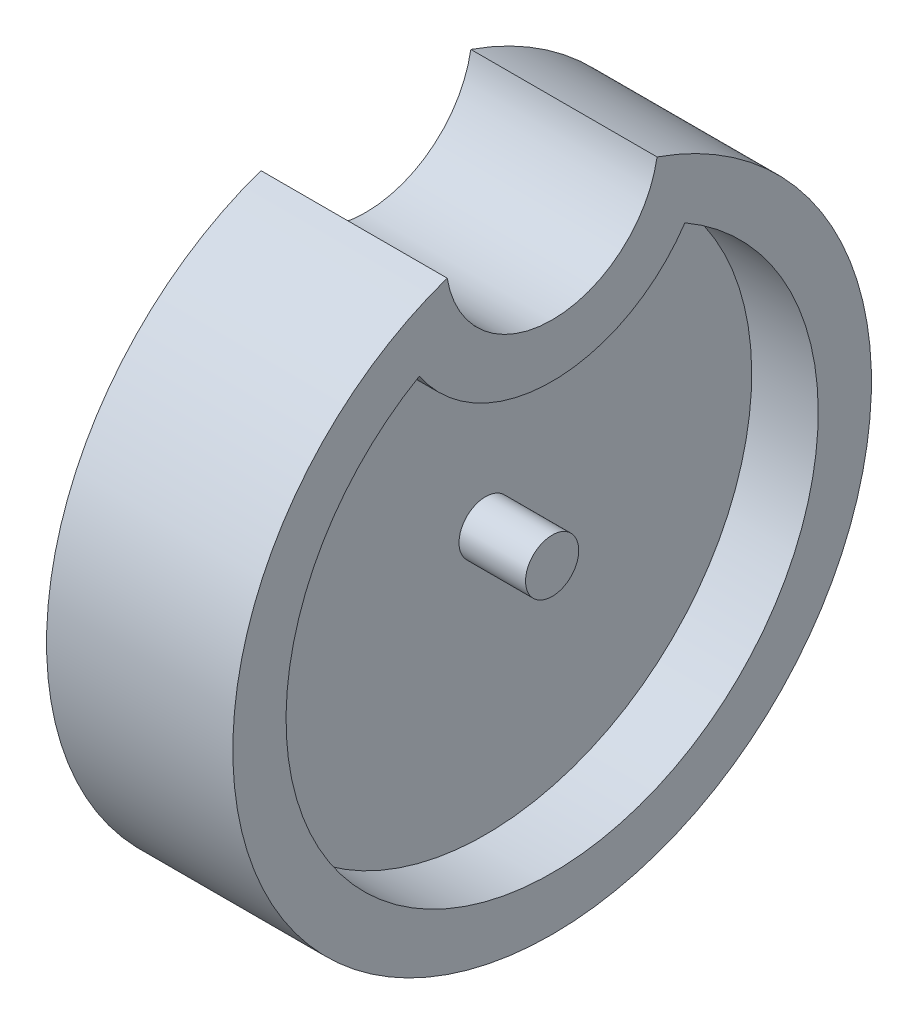
ISO-10303-21;
HEADER;
FILE_DESCRIPTION(('STEP AP214'),'2;1');
FILE_NAME('part.step','',(''),(''),'','','');
FILE_SCHEMA(('AUTOMOTIVE_DESIGN { 1 0 10303 214 1 1 1 1 }'));
ENDSEC;
DATA;
#1=APPLICATION_CONTEXT('core data for automotive mechanical design processes');
#2=APPLICATION_PROTOCOL_DEFINITION('international standard','automotive_design',2000,#1);
#3=PRODUCT_CONTEXT('',#1,'mechanical');
#4=PRODUCT('Part','Part','',(#3));
#5=PRODUCT_RELATED_PRODUCT_CATEGORY('part','',(#4));
#6=PRODUCT_DEFINITION_FORMATION('','',#4);
#7=PRODUCT_DEFINITION_CONTEXT('part definition',#1,'design');
#8=PRODUCT_DEFINITION('design','',#6,#7);
#9=PRODUCT_DEFINITION_SHAPE('','',#8);
#10=(LENGTH_UNIT() NAMED_UNIT(*) SI_UNIT(.MILLI.,.METRE.));
#11=(NAMED_UNIT(*) PLANE_ANGLE_UNIT() SI_UNIT($,.RADIAN.));
#12=(NAMED_UNIT(*) SI_UNIT($,.STERADIAN.) SOLID_ANGLE_UNIT());
#13=UNCERTAINTY_MEASURE_WITH_UNIT(LENGTH_MEASURE(1.E-05),#10,'distance_accuracy_value','');
#14=(GEOMETRIC_REPRESENTATION_CONTEXT(3) GLOBAL_UNCERTAINTY_ASSIGNED_CONTEXT((#13)) GLOBAL_UNIT_ASSIGNED_CONTEXT((#10,
#11,#12)) REPRESENTATION_CONTEXT('',''));
#15=CARTESIAN_POINT('',(0.,0.,0.));
#16=DIRECTION('',(0.,0.,1.));
#17=DIRECTION('',(1.,0.,0.));
#18=AXIS2_PLACEMENT_3D('',#15,#16,#17);
#19=CARTESIAN_POINT('',(5.55625,0.,0.));
#20=DIRECTION('',(-1.,0.,0.));
#21=DIRECTION('',(0.,0.,1.));
#22=AXIS2_PLACEMENT_3D('',#19,#20,#21);
#23=CYLINDRICAL_SURFACE('',#22,15.875);
#24=DIRECTION('',(-1.,0.,0.));
#25=VECTOR('',#24,1.);
#26=CARTESIAN_POINT('',(5.55625,13.7583333333333,7.91984146867151));
#27=LINE('',#26,#25);
#28=CARTESIAN_POINT('',(-1.5875,13.7583333333333,7.91984146867151));
#29=VERTEX_POINT('',#28);
#30=CARTESIAN_POINT('',(-5.55625,13.7583333333333,7.91984146867151));
#31=VERTEX_POINT('',#30);
#32=EDGE_CURVE('E103',#29,#31,#27,.T.);
#33=ORIENTED_EDGE('',*,*,#32,.F.);
#34=CARTESIAN_POINT('',(-1.5875,0.,0.));
#35=DIRECTION('',(1.,0.,0.));
#36=DIRECTION('',(0.,0.,-1.));
#37=AXIS2_PLACEMENT_3D('',#34,#35,#36);
#38=CIRCLE('',#37,15.875);
#39=CARTESIAN_POINT('',(-1.5875,13.7583333333333,-7.91984146867151));
#40=VERTEX_POINT('',#39);
#41=EDGE_CURVE('E56',#29,#40,#38,.T.);
#42=ORIENTED_EDGE('',*,*,#41,.T.);
#43=DIRECTION('',(-1.,0.,0.));
#44=VECTOR('',#43,1.);
#45=CARTESIAN_POINT('',(5.55625,13.7583333333333,-7.91984146867151));
#46=LINE('',#45,#44);
#47=CARTESIAN_POINT('',(-5.55625,13.7583333333333,-7.91984146867151));
#48=VERTEX_POINT('',#47);
#49=EDGE_CURVE('E102',#40,#48,#46,.T.);
#50=ORIENTED_EDGE('',*,*,#49,.T.);
#51=CARTESIAN_POINT('',(-5.55625,0.,0.));
#52=DIRECTION('',(1.,0.,0.));
#53=DIRECTION('',(0.,0.,-1.));
#54=AXIS2_PLACEMENT_3D('',#51,#52,#53);
#55=CIRCLE('',#54,15.875);
#56=EDGE_CURVE('E111',#31,#48,#55,.T.);
#57=ORIENTED_EDGE('',*,*,#56,.F.);
#58=EDGE_LOOP('',(#33,#42,#50,#57));
#59=FACE_BOUND('',#58,.T.);
#60=ADVANCED_FACE('F39',(#59),#23,.F.);
#61=CARTESIAN_POINT('',(5.55625,19.05,0.));
#62=DIRECTION('',(-1.,0.,0.));
#63=DIRECTION('',(0.,0.,1.));
#64=AXIS2_PLACEMENT_3D('',#61,#62,#63);
#65=CYLINDRICAL_SURFACE('',#64,9.525);
#66=ORIENTED_EDGE('',*,*,#49,.F.);
#67=CARTESIAN_POINT('',(-1.5875,19.05,0.));
#68=DIRECTION('',(1.,0.,0.));
#69=DIRECTION('',(0.,0.,-1.));
#70=AXIS2_PLACEMENT_3D('',#67,#68,#69);
#71=CIRCLE('',#70,9.525);
#72=EDGE_CURVE('E117',#29,#40,#71,.T.);
#73=ORIENTED_EDGE('',*,*,#72,.F.);
#74=ORIENTED_EDGE('',*,*,#32,.T.);
#75=CARTESIAN_POINT('',(-5.55625,19.05,0.));
#76=DIRECTION('',(-1.,0.,0.));
#77=DIRECTION('',(0.,0.,-1.));
#78=AXIS2_PLACEMENT_3D('',#75,#76,#77);
#79=CIRCLE('',#78,9.525);
#80=EDGE_CURVE('E126',#48,#31,#79,.T.);
#81=ORIENTED_EDGE('',*,*,#80,.F.);
#82=EDGE_LOOP('',(#66,#73,#74,#81));
#83=FACE_BOUND('',#82,.T.);
#84=ADVANCED_FACE('F176',(#83),#65,.T.);
#85=CARTESIAN_POINT('',(5.55625,9.525,0.));
#86=DIRECTION('',(1.,0.,0.));
#87=DIRECTION('',(0.,0.,-1.));
#88=AXIS2_PLACEMENT_3D('',#85,#86,#87);
#89=PLANE('',#88);
#90=CARTESIAN_POINT('',(5.55625,19.05,0.));
#91=DIRECTION('',(-1.,0.,0.));
#92=DIRECTION('',(0.,0.,-1.));
#93=AXIS2_PLACEMENT_3D('',#90,#91,#92);
#94=CIRCLE('',#93,6.35);
#95=CARTESIAN_POINT('',(5.55625,17.9916666666667,-6.26118443711376));
#96=VERTEX_POINT('',#95);
#97=CARTESIAN_POINT('',(5.55625,17.9916666666667,6.26118443711376));
#98=VERTEX_POINT('',#97);
#99=EDGE_CURVE('E138',#96,#98,#94,.T.);
#100=ORIENTED_EDGE('',*,*,#99,.T.);
#101=CARTESIAN_POINT('',(5.55625,0.,0.));
#102=DIRECTION('',(1.,0.,0.));
#103=DIRECTION('',(0.,0.,-1.));
#104=AXIS2_PLACEMENT_3D('',#101,#102,#103);
#105=CIRCLE('',#104,19.05);
#106=EDGE_CURVE('E142',#98,#96,#105,.T.);
#107=ORIENTED_EDGE('',*,*,#106,.T.);
#108=EDGE_LOOP('',(#100,#107));
#109=FACE_BOUND('',#108,.T.);
#110=CARTESIAN_POINT('',(5.55625,19.05,0.));
#111=DIRECTION('',(-1.,0.,0.));
#112=DIRECTION('',(0.,0.,-1.));
#113=AXIS2_PLACEMENT_3D('',#110,#111,#112);
#114=CIRCLE('',#113,9.525);
#115=CARTESIAN_POINT('',(5.55625,13.7583333333333,-7.91984146867151));
#116=VERTEX_POINT('',#115);
#117=CARTESIAN_POINT('',(5.55625,13.7583333333333,7.91984146867151));
#118=VERTEX_POINT('',#117);
#119=EDGE_CURVE('E97',#116,#118,#114,.T.);
#120=ORIENTED_EDGE('',*,*,#119,.F.);
#121=CARTESIAN_POINT('',(5.55625,0.,0.));
#122=DIRECTION('',(1.,0.,0.));
#123=DIRECTION('',(0.,0.,-1.));
#124=AXIS2_PLACEMENT_3D('',#121,#122,#123);
#125=CIRCLE('',#124,15.875);
#126=EDGE_CURVE('E123',#118,#116,#125,.T.);
#127=ORIENTED_EDGE('',*,*,#126,.F.);
#128=EDGE_LOOP('',(#120,#127));
#129=FACE_BOUND('',#128,.T.);
#130=ADVANCED_FACE('F167',(#109,#129),#89,.T.);
#131=CARTESIAN_POINT('',(-5.55625,9.525,0.));
#132=DIRECTION('',(1.,0.,0.));
#133=DIRECTION('',(0.,0.,-1.));
#134=AXIS2_PLACEMENT_3D('',#131,#132,#133);
#135=PLANE('',#134);
#136=CARTESIAN_POINT('',(-5.55625,19.05,0.));
#137=DIRECTION('',(-1.,0.,0.));
#138=DIRECTION('',(0.,0.,-1.));
#139=AXIS2_PLACEMENT_3D('',#136,#137,#138);
#140=CIRCLE('',#139,6.35);
#141=CARTESIAN_POINT('',(-5.55625,17.9916666666667,-6.26118443711376));
#142=VERTEX_POINT('',#141);
#143=CARTESIAN_POINT('',(-5.55625,17.9916666666667,6.26118443711376));
#144=VERTEX_POINT('',#143);
#145=EDGE_CURVE('E137',#142,#144,#140,.T.);
#146=ORIENTED_EDGE('',*,*,#145,.F.);
#147=CARTESIAN_POINT('',(-5.55625,0.,0.));
#148=DIRECTION('',(1.,0.,0.));
#149=DIRECTION('',(0.,0.,-1.));
#150=AXIS2_PLACEMENT_3D('',#147,#148,#149);
#151=CIRCLE('',#150,19.05);
#152=EDGE_CURVE('E143',#144,#142,#151,.T.);
#153=ORIENTED_EDGE('',*,*,#152,.F.);
#154=EDGE_LOOP('',(#146,#153));
#155=FACE_BOUND('',#154,.T.);
#156=ORIENTED_EDGE('',*,*,#56,.T.);
#157=ORIENTED_EDGE('',*,*,#80,.T.);
#158=EDGE_LOOP('',(#156,#157));
#159=FACE_BOUND('',#158,.T.);
#160=ADVANCED_FACE('F164',(#155,#159),#135,.F.);
#161=CARTESIAN_POINT('',(5.55625,19.05,0.));
#162=DIRECTION('',(-1.,0.,0.));
#163=DIRECTION('',(0.,0.,1.));
#164=AXIS2_PLACEMENT_3D('',#161,#162,#163);
#165=CYLINDRICAL_SURFACE('',#164,6.35);
#166=ORIENTED_EDGE('',*,*,#145,.T.);
#167=DIRECTION('',(-1.,0.,0.));
#168=VECTOR('',#167,1.);
#169=CARTESIAN_POINT('',(5.55625,17.9916666666667,6.26118443711376));
#170=LINE('',#169,#168);
#171=EDGE_CURVE('E49',#98,#144,#170,.T.);
#172=ORIENTED_EDGE('',*,*,#171,.F.);
#173=ORIENTED_EDGE('',*,*,#99,.F.);
#174=DIRECTION('',(-1.,0.,0.));
#175=VECTOR('',#174,1.);
#176=CARTESIAN_POINT('',(5.55625,17.9916666666667,-6.26118443711376));
#177=LINE('',#176,#175);
#178=EDGE_CURVE('E146',#96,#142,#177,.T.);
#179=ORIENTED_EDGE('',*,*,#178,.T.);
#180=EDGE_LOOP('',(#166,#172,#173,#179));
#181=FACE_BOUND('',#180,.T.);
#182=ADVANCED_FACE('F41',(#181),#165,.F.);
#183=CARTESIAN_POINT('',(5.55625,0.,0.));
#184=DIRECTION('',(-1.,0.,0.));
#185=DIRECTION('',(0.,0.,1.));
#186=AXIS2_PLACEMENT_3D('',#183,#184,#185);
#187=CYLINDRICAL_SURFACE('',#186,19.05);
#188=ORIENTED_EDGE('',*,*,#152,.T.);
#189=ORIENTED_EDGE('',*,*,#178,.F.);
#190=ORIENTED_EDGE('',*,*,#106,.F.);
#191=ORIENTED_EDGE('',*,*,#171,.T.);
#192=EDGE_LOOP('',(#188,#189,#190,#191));
#193=FACE_BOUND('',#192,.T.);
#194=ADVANCED_FACE('F158',(#193),#187,.T.);
#195=CARTESIAN_POINT('',(1.5875,0.,0.));
#196=DIRECTION('',(1.,0.,0.));
#197=DIRECTION('',(0.,0.,-1.));
#198=AXIS2_PLACEMENT_3D('',#195,#196,#197);
#199=CIRCLE('',#198,15.875);
#200=CARTESIAN_POINT('',(1.5875,13.7583333333333,7.91984146867151));
#201=VERTEX_POINT('',#200);
#202=CARTESIAN_POINT('',(1.5875,13.7583333333333,-7.91984146867151));
#203=VERTEX_POINT('',#202);
#204=EDGE_CURVE('E106',#201,#203,#199,.T.);
#205=ORIENTED_EDGE('',*,*,#204,.F.);
#206=EDGE_CURVE('E93',#118,#201,#27,.T.);
#207=ORIENTED_EDGE('',*,*,#206,.F.);
#208=ORIENTED_EDGE('',*,*,#126,.T.);
#209=EDGE_CURVE('E108',#116,#203,#46,.T.);
#210=ORIENTED_EDGE('',*,*,#209,.T.);
#211=EDGE_LOOP('',(#205,#207,#208,#210));
#212=FACE_BOUND('',#211,.T.);
#213=ADVANCED_FACE('F107',(#212),#23,.F.);
#214=CARTESIAN_POINT('',(1.5875,19.05,0.));
#215=DIRECTION('',(1.,0.,0.));
#216=DIRECTION('',(0.,0.,-1.));
#217=AXIS2_PLACEMENT_3D('',#214,#215,#216);
#218=CIRCLE('',#217,9.525);
#219=EDGE_CURVE('E64',#201,#203,#218,.T.);
#220=ORIENTED_EDGE('',*,*,#219,.T.);
#221=ORIENTED_EDGE('',*,*,#209,.F.);
#222=ORIENTED_EDGE('',*,*,#119,.T.);
#223=ORIENTED_EDGE('',*,*,#206,.T.);
#224=EDGE_LOOP('',(#220,#221,#222,#223));
#225=FACE_BOUND('',#224,.T.);
#226=ADVANCED_FACE('F95',(#225),#65,.T.);
#227=CARTESIAN_POINT('',(-1.5875,9.52500000000001,0.));
#228=DIRECTION('',(1.,0.,0.));
#229=DIRECTION('',(0.,0.,-1.));
#230=AXIS2_PLACEMENT_3D('',#227,#228,#229);
#231=PLANE('',#230);
#232=CARTESIAN_POINT('',(-1.5875,0.,0.));
#233=DIRECTION('',(1.,0.,0.));
#234=DIRECTION('',(0.,0.,-1.));
#235=AXIS2_PLACEMENT_3D('',#232,#233,#234);
#236=CIRCLE('',#235,1.5875);
#237=CARTESIAN_POINT('',(-1.5875,0.,-1.5875));
#238=VERTEX_POINT('',#237);
#239=EDGE_CURVE('E11',#238,#238,#236,.F.);
#240=ORIENTED_EDGE('',*,*,#239,.F.);
#241=EDGE_LOOP('',(#240));
#242=FACE_BOUND('',#241,.T.);
#243=ORIENTED_EDGE('',*,*,#72,.T.);
#244=ORIENTED_EDGE('',*,*,#41,.F.);
#245=EDGE_LOOP('',(#243,#244));
#246=FACE_BOUND('',#245,.T.);
#247=ADVANCED_FACE('F178',(#242,#246),#231,.F.);
#248=CARTESIAN_POINT('',(1.5875,9.52500000000001,0.));
#249=DIRECTION('',(1.,0.,0.));
#250=DIRECTION('',(0.,0.,-1.));
#251=AXIS2_PLACEMENT_3D('',#248,#249,#250);
#252=PLANE('',#251);
#253=CARTESIAN_POINT('',(1.5875,0.,0.));
#254=DIRECTION('',(1.,0.,0.));
#255=DIRECTION('',(0.,0.,-1.));
#256=AXIS2_PLACEMENT_3D('',#253,#254,#255);
#257=CIRCLE('',#256,1.5875);
#258=CARTESIAN_POINT('',(1.5875,0.,-1.5875));
#259=VERTEX_POINT('',#258);
#260=EDGE_CURVE('E43',#259,#259,#257,.F.);
#261=ORIENTED_EDGE('',*,*,#260,.T.);
#262=EDGE_LOOP('',(#261));
#263=FACE_BOUND('',#262,.T.);
#264=ORIENTED_EDGE('',*,*,#219,.F.);
#265=ORIENTED_EDGE('',*,*,#204,.T.);
#266=EDGE_LOOP('',(#264,#265));
#267=FACE_BOUND('',#266,.T.);
#268=ADVANCED_FACE('F113',(#263,#267),#252,.T.);
#269=CARTESIAN_POINT('',(5.55625,0.,0.));
#270=DIRECTION('',(1.,0.,0.));
#271=DIRECTION('',(0.,0.,-1.));
#272=AXIS2_PLACEMENT_3D('',#269,#270,#271);
#273=PLANE('',#272);
#274=CARTESIAN_POINT('',(5.55625,0.,0.));
#275=DIRECTION('',(1.,0.,0.));
#276=DIRECTION('',(0.,0.,-1.));
#277=AXIS2_PLACEMENT_3D('',#274,#275,#276);
#278=CIRCLE('',#277,1.5875);
#279=CARTESIAN_POINT('',(5.55625,0.,-1.5875));
#280=VERTEX_POINT('',#279);
#281=EDGE_CURVE('E297',#280,#280,#278,.T.);
#282=ORIENTED_EDGE('',*,*,#281,.T.);
#283=EDGE_LOOP('',(#282));
#284=FACE_BOUND('',#283,.T.);
#285=ADVANCED_FACE('F186',(#284),#273,.T.);
#286=CARTESIAN_POINT('',(5.55625,0.,0.));
#287=DIRECTION('',(-1.,0.,0.));
#288=DIRECTION('',(0.,0.,1.));
#289=AXIS2_PLACEMENT_3D('',#286,#287,#288);
#290=CYLINDRICAL_SURFACE('',#289,1.5875);
#291=ORIENTED_EDGE('',*,*,#260,.F.);
#292=EDGE_LOOP('',(#291));
#293=FACE_BOUND('',#292,.T.);
#294=ORIENTED_EDGE('',*,*,#281,.F.);
#295=EDGE_LOOP('',(#294));
#296=FACE_BOUND('',#295,.T.);
#297=ADVANCED_FACE('F260',(#293,#296),#290,.T.);
#298=CARTESIAN_POINT('',(-5.55625,0.,0.));
#299=DIRECTION('',(1.,0.,0.));
#300=DIRECTION('',(0.,0.,-1.));
#301=AXIS2_PLACEMENT_3D('',#298,#299,#300);
#302=CIRCLE('',#301,1.5875);
#303=CARTESIAN_POINT('',(-5.55625,0.,-1.5875));
#304=VERTEX_POINT('',#303);
#305=EDGE_CURVE('E295',#304,#304,#302,.T.);
#306=ORIENTED_EDGE('',*,*,#305,.T.);
#307=EDGE_LOOP('',(#306));
#308=FACE_BOUND('',#307,.T.);
#309=ORIENTED_EDGE('',*,*,#239,.T.);
#310=EDGE_LOOP('',(#309));
#311=FACE_BOUND('',#310,.T.);
#312=ADVANCED_FACE('F270',(#308,#311),#290,.T.);
#313=CARTESIAN_POINT('',(-5.55625,0.,0.));
#314=DIRECTION('',(1.,0.,0.));
#315=DIRECTION('',(0.,0.,-1.));
#316=AXIS2_PLACEMENT_3D('',#313,#314,#315);
#317=PLANE('',#316);
#318=ORIENTED_EDGE('',*,*,#305,.F.);
#319=EDGE_LOOP('',(#318));
#320=FACE_BOUND('',#319,.T.);
#321=ADVANCED_FACE('F280',(#320),#317,.F.);
#322=CLOSED_SHELL('',(#60,#84,#130,#160,#182,#194,#213,#226,#247,#268,#285,#297,#312,#321));
#323=MANIFOLD_SOLID_BREP('B2',#322);
#324=ADVANCED_BREP_SHAPE_REPRESENTATION('',(#18,#323),#14);
#325=SHAPE_DEFINITION_REPRESENTATION(#9,#324);
ENDSEC;
END-ISO-10303-21;
